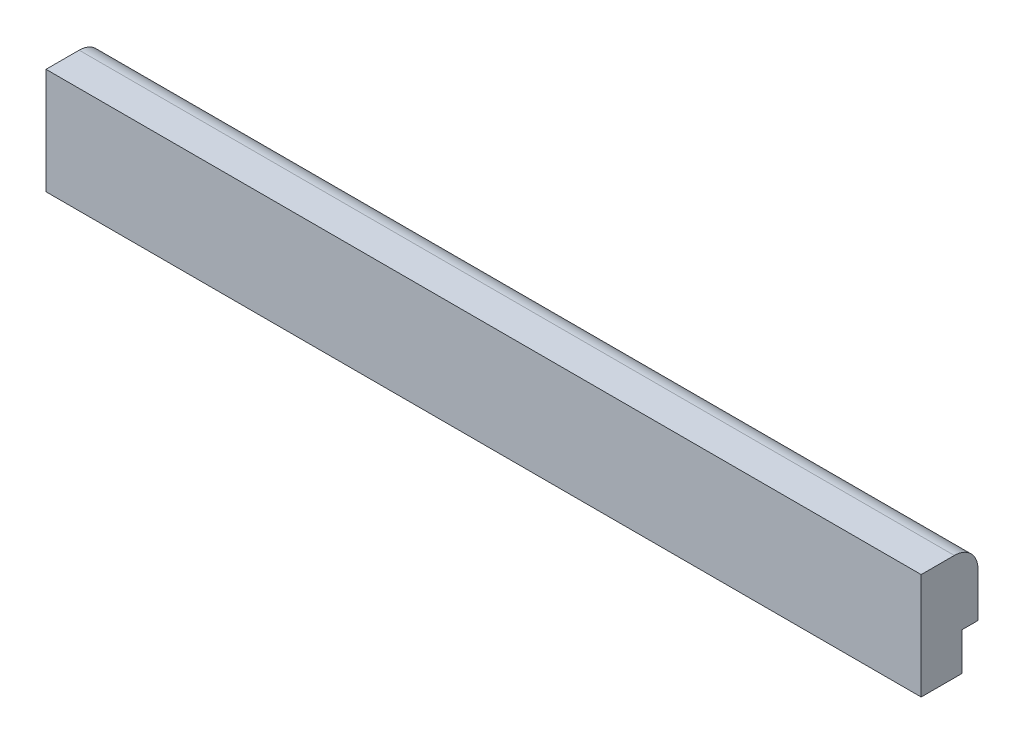
ISO-10303-21;
HEADER;
FILE_DESCRIPTION(('STEP AP214'),'2;1');
FILE_NAME('part.step','',(''),(''),'','','');
FILE_SCHEMA(('AUTOMOTIVE_DESIGN { 1 0 10303 214 1 1 1 1 }'));
ENDSEC;
DATA;
#1=APPLICATION_CONTEXT('core data for automotive mechanical design processes');
#2=APPLICATION_PROTOCOL_DEFINITION('international standard','automotive_design',2000,#1);
#3=PRODUCT_CONTEXT('',#1,'mechanical');
#4=PRODUCT('Part','Part','',(#3));
#5=PRODUCT_RELATED_PRODUCT_CATEGORY('part','',(#4));
#6=PRODUCT_DEFINITION_FORMATION('','',#4);
#7=PRODUCT_DEFINITION_CONTEXT('part definition',#1,'design');
#8=PRODUCT_DEFINITION('design','',#6,#7);
#9=PRODUCT_DEFINITION_SHAPE('','',#8);
#10=(LENGTH_UNIT() NAMED_UNIT(*) SI_UNIT(.MILLI.,.METRE.));
#11=(NAMED_UNIT(*) PLANE_ANGLE_UNIT() SI_UNIT($,.RADIAN.));
#12=(NAMED_UNIT(*) SI_UNIT($,.STERADIAN.) SOLID_ANGLE_UNIT());
#13=UNCERTAINTY_MEASURE_WITH_UNIT(LENGTH_MEASURE(1.E-05),#10,'distance_accuracy_value','');
#14=(GEOMETRIC_REPRESENTATION_CONTEXT(3) GLOBAL_UNCERTAINTY_ASSIGNED_CONTEXT((#13)) GLOBAL_UNIT_ASSIGNED_CONTEXT((#10,
#11,#12)) REPRESENTATION_CONTEXT('',''));
#15=CARTESIAN_POINT('',(0.,0.,0.));
#16=DIRECTION('',(0.,0.,1.));
#17=DIRECTION('',(1.,0.,0.));
#18=AXIS2_PLACEMENT_3D('',#15,#16,#17);
#19=CARTESIAN_POINT('',(261.,-20.,21.5));
#20=DIRECTION('',(-1.,0.,0.));
#21=DIRECTION('',(0.,0.,1.));
#22=AXIS2_PLACEMENT_3D('',#19,#20,#21);
#23=PLANE('',#22);
#24=DIRECTION('',(0.,-1.,0.));
#25=VECTOR('',#24,1.);
#26=CARTESIAN_POINT('',(261.,-20.,-8.49999999999995));
#27=LINE('',#26,#25);
#28=CARTESIAN_POINT('',(261.,23.5,-8.49999999999995));
#29=VERTEX_POINT('',#28);
#30=CARTESIAN_POINT('',(261.,0.,-8.49999999999995));
#31=VERTEX_POINT('',#30);
#32=EDGE_CURVE('E127',#29,#31,#27,.T.);
#33=ORIENTED_EDGE('',*,*,#32,.F.);
#34=CARTESIAN_POINT('',(261.,23.5,4.00000000000005));
#35=DIRECTION('',(-1.,0.,0.));
#36=DIRECTION('',(0.,0.,1.));
#37=AXIS2_PLACEMENT_3D('',#34,#35,#36);
#38=CIRCLE('',#37,12.5);
#39=CARTESIAN_POINT('',(261.,36.,4.00000000000005));
#40=VERTEX_POINT('',#39);
#41=EDGE_CURVE('E59',#29,#40,#38,.F.);
#42=ORIENTED_EDGE('',*,*,#41,.T.);
#43=DIRECTION('',(0.,0.,-1.));
#44=VECTOR('',#43,1.);
#45=CARTESIAN_POINT('',(261.,36.,21.5));
#46=LINE('',#45,#44);
#47=CARTESIAN_POINT('',(261.,36.,21.5));
#48=VERTEX_POINT('',#47);
#49=EDGE_CURVE('E146',#48,#40,#46,.T.);
#50=ORIENTED_EDGE('',*,*,#49,.F.);
#51=DIRECTION('',(0.,1.,0.));
#52=VECTOR('',#51,1.);
#53=CARTESIAN_POINT('',(261.,-20.,21.5));
#54=LINE('',#53,#52);
#55=CARTESIAN_POINT('',(261.,-20.,21.5));
#56=VERTEX_POINT('',#55);
#57=EDGE_CURVE('E129',#56,#48,#54,.T.);
#58=ORIENTED_EDGE('',*,*,#57,.F.);
#59=DIRECTION('',(0.,0.,-1.));
#60=VECTOR('',#59,1.);
#61=CARTESIAN_POINT('',(261.,-20.,21.5));
#62=LINE('',#61,#60);
#63=CARTESIAN_POINT('',(261.,-20.0000000000001,0.));
#64=VERTEX_POINT('',#63);
#65=EDGE_CURVE('E116',#56,#64,#62,.T.);
#66=ORIENTED_EDGE('',*,*,#65,.T.);
#67=DIRECTION('',(0.,1.,0.));
#68=VECTOR('',#67,1.);
#69=CARTESIAN_POINT('',(261.,-20.0000000000001,0.));
#70=LINE('',#69,#68);
#71=CARTESIAN_POINT('',(261.,0.,0.));
#72=VERTEX_POINT('',#71);
#73=EDGE_CURVE('E109',#64,#72,#70,.T.);
#74=ORIENTED_EDGE('',*,*,#73,.T.);
#75=DIRECTION('',(0.,0.,-1.));
#76=VECTOR('',#75,1.);
#77=CARTESIAN_POINT('',(261.,0.,462.432697805854));
#78=LINE('',#77,#76);
#79=EDGE_CURVE('E96',#72,#31,#78,.T.);
#80=ORIENTED_EDGE('',*,*,#79,.T.);
#81=EDGE_LOOP('',(#33,#42,#50,#58,#66,#74,#80));
#82=FACE_BOUND('',#81,.T.);
#83=ADVANCED_FACE('F37',(#82),#23,.F.);
#84=CARTESIAN_POINT('',(261.,36.,21.5));
#85=DIRECTION('',(0.,-1.,0.));
#86=DIRECTION('',(1.,0.,0.));
#87=AXIS2_PLACEMENT_3D('',#84,#85,#86);
#88=PLANE('',#87);
#89=ORIENTED_EDGE('',*,*,#49,.T.);
#90=DIRECTION('',(1.,0.,0.));
#91=VECTOR('',#90,1.);
#92=CARTESIAN_POINT('',(261.,36.,4.00000000000005));
#93=LINE('',#92,#91);
#94=CARTESIAN_POINT('',(-201.,35.9999999999999,4.00000000000005));
#95=VERTEX_POINT('',#94);
#96=EDGE_CURVE('E45',#40,#95,#93,.F.);
#97=ORIENTED_EDGE('',*,*,#96,.T.);
#98=DIRECTION('',(0.,0.,-1.));
#99=VECTOR('',#98,1.);
#100=CARTESIAN_POINT('',(-201.,35.9999999999999,21.5));
#101=LINE('',#100,#99);
#102=CARTESIAN_POINT('',(-201.,35.9999999999999,21.5));
#103=VERTEX_POINT('',#102);
#104=EDGE_CURVE('E144',#103,#95,#101,.T.);
#105=ORIENTED_EDGE('',*,*,#104,.F.);
#106=DIRECTION('',(-1.,0.,0.));
#107=VECTOR('',#106,1.);
#108=CARTESIAN_POINT('',(261.,36.,21.5));
#109=LINE('',#108,#107);
#110=EDGE_CURVE('E132',#48,#103,#109,.T.);
#111=ORIENTED_EDGE('',*,*,#110,.F.);
#112=EDGE_LOOP('',(#89,#97,#105,#111));
#113=FACE_BOUND('',#112,.T.);
#114=ADVANCED_FACE('F160',(#113),#88,.F.);
#115=CARTESIAN_POINT('',(-201.,-20.0000000000001,21.5));
#116=DIRECTION('',(-1.,0.,0.));
#117=DIRECTION('',(0.,0.,1.));
#118=AXIS2_PLACEMENT_3D('',#115,#116,#117);
#119=PLANE('',#118);
#120=ORIENTED_EDGE('',*,*,#104,.T.);
#121=CARTESIAN_POINT('',(-201.,23.4999999999999,4.00000000000005));
#122=DIRECTION('',(-1.,0.,0.));
#123=DIRECTION('',(0.,0.,1.));
#124=AXIS2_PLACEMENT_3D('',#121,#122,#123);
#125=CIRCLE('',#124,12.5);
#126=CARTESIAN_POINT('',(-201.,23.4999999999999,-8.49999999999995));
#127=VERTEX_POINT('',#126);
#128=EDGE_CURVE('E11',#95,#127,#125,.T.);
#129=ORIENTED_EDGE('',*,*,#128,.T.);
#130=DIRECTION('',(0.,-1.,0.));
#131=VECTOR('',#130,1.);
#132=CARTESIAN_POINT('',(-201.,-20.0000000000001,-8.49999999999995));
#133=LINE('',#132,#131);
#134=CARTESIAN_POINT('',(-201.,0.,-8.49999999999995));
#135=VERTEX_POINT('',#134);
#136=EDGE_CURVE('E125',#127,#135,#133,.T.);
#137=ORIENTED_EDGE('',*,*,#136,.T.);
#138=DIRECTION('',(0.,0.,-1.));
#139=VECTOR('',#138,1.);
#140=CARTESIAN_POINT('',(-201.,0.,462.432697805854));
#141=LINE('',#140,#139);
#142=CARTESIAN_POINT('',(-201.,0.,0.));
#143=VERTEX_POINT('',#142);
#144=EDGE_CURVE('E123',#143,#135,#141,.T.);
#145=ORIENTED_EDGE('',*,*,#144,.F.);
#146=DIRECTION('',(0.,1.,0.));
#147=VECTOR('',#146,1.);
#148=CARTESIAN_POINT('',(-201.,-20.0000000000001,0.));
#149=LINE('',#148,#147);
#150=CARTESIAN_POINT('',(-201.,-20.0000000000001,0.));
#151=VERTEX_POINT('',#150);
#152=EDGE_CURVE('E105',#151,#143,#149,.T.);
#153=ORIENTED_EDGE('',*,*,#152,.F.);
#154=DIRECTION('',(0.,0.,-1.));
#155=VECTOR('',#154,1.);
#156=CARTESIAN_POINT('',(-201.,-20.0000000000001,21.5));
#157=LINE('',#156,#155);
#158=CARTESIAN_POINT('',(-201.,-20.0000000000001,21.5));
#159=VERTEX_POINT('',#158);
#160=EDGE_CURVE('E141',#159,#151,#157,.T.);
#161=ORIENTED_EDGE('',*,*,#160,.F.);
#162=DIRECTION('',(0.,1.,0.));
#163=VECTOR('',#162,1.);
#164=CARTESIAN_POINT('',(-201.,-20.0000000000001,21.5));
#165=LINE('',#164,#163);
#166=EDGE_CURVE('E134',#159,#103,#165,.T.);
#167=ORIENTED_EDGE('',*,*,#166,.T.);
#168=EDGE_LOOP('',(#120,#129,#137,#145,#153,#161,#167));
#169=FACE_BOUND('',#168,.T.);
#170=ADVANCED_FACE('F158',(#169),#119,.T.);
#171=CARTESIAN_POINT('',(261.,-20.,21.5));
#172=DIRECTION('',(0.,-1.,0.));
#173=DIRECTION('',(1.,0.,0.));
#174=AXIS2_PLACEMENT_3D('',#171,#172,#173);
#175=PLANE('',#174);
#176=DIRECTION('',(1.,0.,0.));
#177=VECTOR('',#176,1.);
#178=CARTESIAN_POINT('',(-201.,-20.0000000000001,0.));
#179=LINE('',#178,#177);
#180=EDGE_CURVE('E117',#151,#64,#179,.T.);
#181=ORIENTED_EDGE('',*,*,#180,.T.);
#182=ORIENTED_EDGE('',*,*,#65,.F.);
#183=DIRECTION('',(-1.,0.,0.));
#184=VECTOR('',#183,1.);
#185=CARTESIAN_POINT('',(261.,-20.,21.5));
#186=LINE('',#185,#184);
#187=EDGE_CURVE('E137',#56,#159,#186,.T.);
#188=ORIENTED_EDGE('',*,*,#187,.T.);
#189=ORIENTED_EDGE('',*,*,#160,.T.);
#190=EDGE_LOOP('',(#181,#182,#188,#189));
#191=FACE_BOUND('',#190,.T.);
#192=ADVANCED_FACE('F165',(#191),#175,.T.);
#193=CARTESIAN_POINT('',(0.,0.,21.5));
#194=DIRECTION('',(0.,0.,1.));
#195=DIRECTION('',(1.,0.,0.));
#196=AXIS2_PLACEMENT_3D('',#193,#194,#195);
#197=PLANE('',#196);
#198=ORIENTED_EDGE('',*,*,#57,.T.);
#199=ORIENTED_EDGE('',*,*,#110,.T.);
#200=ORIENTED_EDGE('',*,*,#166,.F.);
#201=ORIENTED_EDGE('',*,*,#187,.F.);
#202=EDGE_LOOP('',(#198,#199,#200,#201));
#203=FACE_BOUND('',#202,.T.);
#204=ADVANCED_FACE('F163',(#203),#197,.T.);
#205=CARTESIAN_POINT('',(-181.,-20.,-8.49999999999995));
#206=DIRECTION('',(0.,0.,1.));
#207=DIRECTION('',(0.,1.,0.));
#208=AXIS2_PLACEMENT_3D('',#205,#206,#207);
#209=PLANE('',#208);
#210=ORIENTED_EDGE('',*,*,#136,.F.);
#211=DIRECTION('',(1.,0.,0.));
#212=VECTOR('',#211,1.);
#213=CARTESIAN_POINT('',(-181.,23.4999999999999,-8.49999999999995));
#214=LINE('',#213,#212);
#215=EDGE_CURVE('E148',#127,#29,#214,.T.);
#216=ORIENTED_EDGE('',*,*,#215,.T.);
#217=ORIENTED_EDGE('',*,*,#32,.T.);
#218=DIRECTION('',(1.,0.,0.));
#219=VECTOR('',#218,1.);
#220=CARTESIAN_POINT('',(-201.,0.,-8.49999999999995));
#221=LINE('',#220,#219);
#222=EDGE_CURVE('E103',#135,#31,#221,.T.);
#223=ORIENTED_EDGE('',*,*,#222,.F.);
#224=EDGE_LOOP('',(#210,#216,#217,#223));
#225=FACE_BOUND('',#224,.T.);
#226=ADVANCED_FACE('F154',(#225),#209,.F.);
#227=CARTESIAN_POINT('',(-1.11022302462516E-13,-80.,0.));
#228=DIRECTION('',(0.,0.,1.));
#229=DIRECTION('',(1.,0.,0.));
#230=AXIS2_PLACEMENT_3D('',#227,#228,#229);
#231=PLANE('',#230);
#232=ORIENTED_EDGE('',*,*,#152,.T.);
#233=DIRECTION('',(1.,0.,0.));
#234=VECTOR('',#233,1.);
#235=CARTESIAN_POINT('',(-201.,0.,0.));
#236=LINE('',#235,#234);
#237=EDGE_CURVE('E100',#143,#72,#236,.T.);
#238=ORIENTED_EDGE('',*,*,#237,.T.);
#239=ORIENTED_EDGE('',*,*,#73,.F.);
#240=ORIENTED_EDGE('',*,*,#180,.F.);
#241=EDGE_LOOP('',(#232,#238,#239,#240));
#242=FACE_BOUND('',#241,.T.);
#243=ADVANCED_FACE('F108',(#242),#231,.F.);
#244=CARTESIAN_POINT('',(-201.,0.,462.432697805854));
#245=DIRECTION('',(0.,1.,0.));
#246=DIRECTION('',(-1.,0.,0.));
#247=AXIS2_PLACEMENT_3D('',#244,#245,#246);
#248=PLANE('',#247);
#249=ORIENTED_EDGE('',*,*,#144,.T.);
#250=ORIENTED_EDGE('',*,*,#222,.T.);
#251=ORIENTED_EDGE('',*,*,#79,.F.);
#252=ORIENTED_EDGE('',*,*,#237,.F.);
#253=EDGE_LOOP('',(#249,#250,#251,#252));
#254=FACE_BOUND('',#253,.T.);
#255=ADVANCED_FACE('F99',(#254),#248,.F.);
#256=CARTESIAN_POINT('',(-181.,23.4999999999999,4.00000000000005));
#257=DIRECTION('',(1.,0.,0.));
#258=DIRECTION('',(0.,1.,0.));
#259=AXIS2_PLACEMENT_3D('',#256,#257,#258);
#260=CYLINDRICAL_SURFACE('',#259,12.5);
#261=ORIENTED_EDGE('',*,*,#128,.F.);
#262=ORIENTED_EDGE('',*,*,#96,.F.);
#263=ORIENTED_EDGE('',*,*,#41,.F.);
#264=ORIENTED_EDGE('',*,*,#215,.F.);
#265=EDGE_LOOP('',(#261,#262,#263,#264));
#266=FACE_BOUND('',#265,.T.);
#267=ADVANCED_FACE('F39',(#266),#260,.T.);
#268=CLOSED_SHELL('',(#83,#114,#170,#192,#204,#226,#243,#255,#267));
#269=MANIFOLD_SOLID_BREP('B2',#268);
#270=ADVANCED_BREP_SHAPE_REPRESENTATION('',(#18,#269),#14);
#271=SHAPE_DEFINITION_REPRESENTATION(#9,#270);
ENDSEC;
END-ISO-10303-21;
